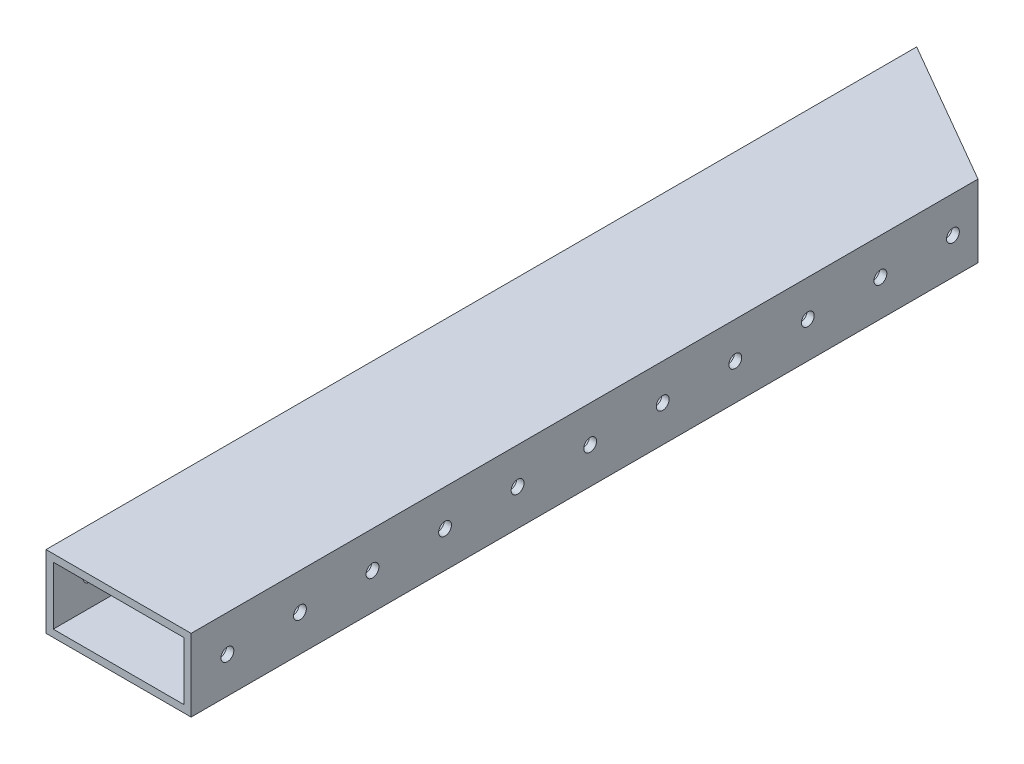
ISO-10303-21;
HEADER;
FILE_DESCRIPTION(('STEP AP214'),'2;1');
FILE_NAME('part.step','',(''),(''),'','','');
FILE_SCHEMA(('AUTOMOTIVE_DESIGN { 1 0 10303 214 1 1 1 1 }'));
ENDSEC;
DATA;
#1=APPLICATION_CONTEXT('core data for automotive mechanical design processes');
#2=APPLICATION_PROTOCOL_DEFINITION('international standard','automotive_design',2000,#1);
#3=PRODUCT_CONTEXT('',#1,'mechanical');
#4=PRODUCT('Part','Part','',(#3));
#5=PRODUCT_RELATED_PRODUCT_CATEGORY('part','',(#4));
#6=PRODUCT_DEFINITION_FORMATION('','',#4);
#7=PRODUCT_DEFINITION_CONTEXT('part definition',#1,'design');
#8=PRODUCT_DEFINITION('design','',#6,#7);
#9=PRODUCT_DEFINITION_SHAPE('','',#8);
#10=(LENGTH_UNIT() NAMED_UNIT(*) SI_UNIT(.MILLI.,.METRE.));
#11=(NAMED_UNIT(*) PLANE_ANGLE_UNIT() SI_UNIT($,.RADIAN.));
#12=(NAMED_UNIT(*) SI_UNIT($,.STERADIAN.) SOLID_ANGLE_UNIT());
#13=UNCERTAINTY_MEASURE_WITH_UNIT(LENGTH_MEASURE(1.E-05),#10,'distance_accuracy_value','');
#14=(GEOMETRIC_REPRESENTATION_CONTEXT(3) GLOBAL_UNCERTAINTY_ASSIGNED_CONTEXT((#13)) GLOBAL_UNIT_ASSIGNED_CONTEXT((#10,
#11,#12)) REPRESENTATION_CONTEXT('',''));
#15=CARTESIAN_POINT('',(0.,0.,0.));
#16=DIRECTION('',(0.,0.,1.));
#17=DIRECTION('',(1.,0.,0.));
#18=AXIS2_PLACEMENT_3D('',#15,#16,#17);
#19=CARTESIAN_POINT('',(-25.4,-12.7,-533.4));
#20=DIRECTION('',(-1.,0.,0.));
#21=DIRECTION('',(0.,0.,1.));
#22=AXIS2_PLACEMENT_3D('',#19,#20,#21);
#23=PLANE('',#22);
#24=DIRECTION('',(0.,-1.,0.));
#25=VECTOR('',#24,1.);
#26=CARTESIAN_POINT('',(-25.4,-12.7,-228.6));
#27=LINE('',#26,#25);
#28=CARTESIAN_POINT('',(-25.4,12.7,-228.6));
#29=VERTEX_POINT('',#28);
#30=CARTESIAN_POINT('',(-25.4,-12.7,-228.6));
#31=VERTEX_POINT('',#30);
#32=EDGE_CURVE('E127',#29,#31,#27,.T.);
#33=ORIENTED_EDGE('',*,*,#32,.F.);
#34=DIRECTION('',(0.,0.,1.));
#35=VECTOR('',#34,1.);
#36=CARTESIAN_POINT('',(-25.4,12.7,-533.4));
#37=LINE('',#36,#35);
#38=CARTESIAN_POINT('',(-25.4,12.7,-533.4));
#39=VERTEX_POINT('',#38);
#40=EDGE_CURVE('E121',#39,#29,#37,.T.);
#41=ORIENTED_EDGE('',*,*,#40,.F.);
#42=DIRECTION('',(0.,-1.,0.));
#43=VECTOR('',#42,1.);
#44=CARTESIAN_POINT('',(-25.4,-12.7,-533.4));
#45=LINE('',#44,#43);
#46=CARTESIAN_POINT('',(-25.4,-12.7,-533.4));
#47=VERTEX_POINT('',#46);
#48=EDGE_CURVE('E104',#39,#47,#45,.T.);
#49=ORIENTED_EDGE('',*,*,#48,.T.);
#50=DIRECTION('',(0.,0.,1.));
#51=VECTOR('',#50,1.);
#52=CARTESIAN_POINT('',(-25.4,-12.7,-533.4));
#53=LINE('',#52,#51);
#54=EDGE_CURVE('E129',#47,#31,#53,.T.);
#55=ORIENTED_EDGE('',*,*,#54,.T.);
#56=EDGE_LOOP('',(#33,#41,#49,#55));
#57=FACE_BOUND('',#56,.T.);
#58=CARTESIAN_POINT('',(-25.4,0.,-241.3));
#59=DIRECTION('',(1.,0.,0.));
#60=DIRECTION('',(0.,0.,-1.));
#61=AXIS2_PLACEMENT_3D('',#58,#59,#60);
#62=CIRCLE('',#61,2.24789999999999);
#63=CARTESIAN_POINT('',(-25.4,0.,-243.5479));
#64=VERTEX_POINT('',#63);
#65=EDGE_CURVE('E202',#64,#64,#62,.T.);
#66=ORIENTED_EDGE('',*,*,#65,.T.);
#67=EDGE_LOOP('',(#66));
#68=FACE_BOUND('',#67,.T.);
#69=CARTESIAN_POINT('',(-25.4,0.,-266.7));
#70=DIRECTION('',(1.,0.,0.));
#71=DIRECTION('',(0.,0.,-1.));
#72=AXIS2_PLACEMENT_3D('',#69,#70,#71);
#73=CIRCLE('',#72,2.24789999999999);
#74=CARTESIAN_POINT('',(-25.4,0.,-268.9479));
#75=VERTEX_POINT('',#74);
#76=EDGE_CURVE('E197',#75,#75,#73,.T.);
#77=ORIENTED_EDGE('',*,*,#76,.T.);
#78=EDGE_LOOP('',(#77));
#79=FACE_BOUND('',#78,.T.);
#80=CARTESIAN_POINT('',(-25.4,0.,-292.1));
#81=DIRECTION('',(1.,0.,0.));
#82=DIRECTION('',(0.,0.,-1.));
#83=AXIS2_PLACEMENT_3D('',#80,#81,#82);
#84=CIRCLE('',#83,2.24789999999999);
#85=CARTESIAN_POINT('',(-25.4,0.,-294.3479));
#86=VERTEX_POINT('',#85);
#87=EDGE_CURVE('E191',#86,#86,#84,.T.);
#88=ORIENTED_EDGE('',*,*,#87,.T.);
#89=EDGE_LOOP('',(#88));
#90=FACE_BOUND('',#89,.T.);
#91=CARTESIAN_POINT('',(-25.4,0.,-317.5));
#92=DIRECTION('',(1.,0.,0.));
#93=DIRECTION('',(0.,0.,-1.));
#94=AXIS2_PLACEMENT_3D('',#91,#92,#93);
#95=CIRCLE('',#94,2.24789999999999);
#96=CARTESIAN_POINT('',(-25.4,0.,-319.7479));
#97=VERTEX_POINT('',#96);
#98=EDGE_CURVE('E185',#97,#97,#95,.T.);
#99=ORIENTED_EDGE('',*,*,#98,.T.);
#100=EDGE_LOOP('',(#99));
#101=FACE_BOUND('',#100,.T.);
#102=CARTESIAN_POINT('',(-25.4,0.,-342.9));
#103=DIRECTION('',(1.,0.,0.));
#104=DIRECTION('',(0.,0.,-1.));
#105=AXIS2_PLACEMENT_3D('',#102,#103,#104);
#106=CIRCLE('',#105,2.24789999999999);
#107=CARTESIAN_POINT('',(-25.4,0.,-345.1479));
#108=VERTEX_POINT('',#107);
#109=EDGE_CURVE('E179',#108,#108,#106,.T.);
#110=ORIENTED_EDGE('',*,*,#109,.T.);
#111=EDGE_LOOP('',(#110));
#112=FACE_BOUND('',#111,.T.);
#113=CARTESIAN_POINT('',(-25.4,0.,-368.3));
#114=DIRECTION('',(1.,0.,0.));
#115=DIRECTION('',(0.,0.,-1.));
#116=AXIS2_PLACEMENT_3D('',#113,#114,#115);
#117=CIRCLE('',#116,2.24789999999999);
#118=CARTESIAN_POINT('',(-25.4,0.,-370.5479));
#119=VERTEX_POINT('',#118);
#120=EDGE_CURVE('E173',#119,#119,#117,.T.);
#121=ORIENTED_EDGE('',*,*,#120,.T.);
#122=EDGE_LOOP('',(#121));
#123=FACE_BOUND('',#122,.T.);
#124=CARTESIAN_POINT('',(-25.4,0.,-393.7));
#125=DIRECTION('',(1.,0.,0.));
#126=DIRECTION('',(0.,0.,-1.));
#127=AXIS2_PLACEMENT_3D('',#124,#125,#126);
#128=CIRCLE('',#127,2.24789999999999);
#129=CARTESIAN_POINT('',(-25.4,0.,-395.9479));
#130=VERTEX_POINT('',#129);
#131=EDGE_CURVE('E167',#130,#130,#128,.T.);
#132=ORIENTED_EDGE('',*,*,#131,.T.);
#133=EDGE_LOOP('',(#132));
#134=FACE_BOUND('',#133,.T.);
#135=CARTESIAN_POINT('',(-25.4,0.,-419.1));
#136=DIRECTION('',(1.,0.,0.));
#137=DIRECTION('',(0.,0.,-1.));
#138=AXIS2_PLACEMENT_3D('',#135,#136,#137);
#139=CIRCLE('',#138,2.24789999999999);
#140=CARTESIAN_POINT('',(-25.4,0.,-421.3479));
#141=VERTEX_POINT('',#140);
#142=EDGE_CURVE('E161',#141,#141,#139,.T.);
#143=ORIENTED_EDGE('',*,*,#142,.T.);
#144=EDGE_LOOP('',(#143));
#145=FACE_BOUND('',#144,.T.);
#146=CARTESIAN_POINT('',(-25.4,0.,-444.5));
#147=DIRECTION('',(1.,0.,0.));
#148=DIRECTION('',(0.,0.,-1.));
#149=AXIS2_PLACEMENT_3D('',#146,#147,#148);
#150=CIRCLE('',#149,2.24789999999999);
#151=CARTESIAN_POINT('',(-25.4,0.,-446.7479));
#152=VERTEX_POINT('',#151);
#153=EDGE_CURVE('E155',#152,#152,#150,.T.);
#154=ORIENTED_EDGE('',*,*,#153,.T.);
#155=EDGE_LOOP('',(#154));
#156=FACE_BOUND('',#155,.T.);
#157=CARTESIAN_POINT('',(-25.4,0.,-469.9));
#158=DIRECTION('',(1.,0.,0.));
#159=DIRECTION('',(0.,0.,-1.));
#160=AXIS2_PLACEMENT_3D('',#157,#158,#159);
#161=CIRCLE('',#160,2.24789999999999);
#162=CARTESIAN_POINT('',(-25.4,0.,-472.1479));
#163=VERTEX_POINT('',#162);
#164=EDGE_CURVE('E149',#163,#163,#161,.T.);
#165=ORIENTED_EDGE('',*,*,#164,.T.);
#166=EDGE_LOOP('',(#165));
#167=FACE_BOUND('',#166,.T.);
#168=CARTESIAN_POINT('',(-25.4,0.,-495.3));
#169=DIRECTION('',(1.,0.,0.));
#170=DIRECTION('',(0.,0.,-1.));
#171=AXIS2_PLACEMENT_3D('',#168,#169,#170);
#172=CIRCLE('',#171,2.24789999999999);
#173=CARTESIAN_POINT('',(-25.4,0.,-497.5479));
#174=VERTEX_POINT('',#173);
#175=EDGE_CURVE('E143',#174,#174,#172,.T.);
#176=ORIENTED_EDGE('',*,*,#175,.T.);
#177=EDGE_LOOP('',(#176));
#178=FACE_BOUND('',#177,.T.);
#179=CARTESIAN_POINT('',(-25.4,0.,-520.7));
#180=DIRECTION('',(1.,0.,0.));
#181=DIRECTION('',(0.,0.,-1.));
#182=AXIS2_PLACEMENT_3D('',#179,#180,#181);
#183=CIRCLE('',#182,2.24789999999999);
#184=CARTESIAN_POINT('',(-25.4,0.,-522.9479));
#185=VERTEX_POINT('',#184);
#186=EDGE_CURVE('E229',#185,#185,#183,.T.);
#187=ORIENTED_EDGE('',*,*,#186,.T.);
#188=EDGE_LOOP('',(#187));
#189=FACE_BOUND('',#188,.T.);
#190=ADVANCED_FACE('F38',(#57,#68,#79,#90,#101,#112,#123,#134,#145,#156,#167,#178,#189),#23,.T.);
#191=CARTESIAN_POINT('',(25.4,-12.7,-533.4));
#192=DIRECTION('',(1.,0.,0.));
#193=DIRECTION('',(0.,0.,-1.));
#194=AXIS2_PLACEMENT_3D('',#191,#192,#193);
#195=PLANE('',#194);
#196=DIRECTION('',(0.,1.,0.));
#197=VECTOR('',#196,1.);
#198=CARTESIAN_POINT('',(25.4,-27.94,-504.070606325167));
#199=LINE('',#198,#197);
#200=CARTESIAN_POINT('',(25.4,-12.7,-504.070606325167));
#201=VERTEX_POINT('',#200);
#202=CARTESIAN_POINT('',(25.4,12.7,-504.070606325167));
#203=VERTEX_POINT('',#202);
#204=EDGE_CURVE('E123',#201,#203,#199,.T.);
#205=ORIENTED_EDGE('',*,*,#204,.T.);
#206=DIRECTION('',(0.,0.,1.));
#207=VECTOR('',#206,1.);
#208=CARTESIAN_POINT('',(25.4,12.7,-533.4));
#209=LINE('',#208,#207);
#210=CARTESIAN_POINT('',(25.4,12.7,-228.6));
#211=VERTEX_POINT('',#210);
#212=EDGE_CURVE('E61',#203,#211,#209,.T.);
#213=ORIENTED_EDGE('',*,*,#212,.T.);
#214=DIRECTION('',(0.,1.,0.));
#215=VECTOR('',#214,1.);
#216=CARTESIAN_POINT('',(25.4,-12.7,-228.6));
#217=LINE('',#216,#215);
#218=CARTESIAN_POINT('',(25.4,-12.7,-228.6));
#219=VERTEX_POINT('',#218);
#220=EDGE_CURVE('E345',#219,#211,#217,.T.);
#221=ORIENTED_EDGE('',*,*,#220,.F.);
#222=DIRECTION('',(0.,0.,1.));
#223=VECTOR('',#222,1.);
#224=CARTESIAN_POINT('',(25.4,-12.7,-533.4));
#225=LINE('',#224,#223);
#226=EDGE_CURVE('E133',#201,#219,#225,.T.);
#227=ORIENTED_EDGE('',*,*,#226,.F.);
#228=EDGE_LOOP('',(#205,#213,#221,#227));
#229=FACE_BOUND('',#228,.T.);
#230=CARTESIAN_POINT('',(25.4,0.,-241.3));
#231=DIRECTION('',(1.,0.,0.));
#232=DIRECTION('',(0.,0.,-1.));
#233=AXIS2_PLACEMENT_3D('',#230,#231,#232);
#234=CIRCLE('',#233,2.24789999999999);
#235=CARTESIAN_POINT('',(25.4,0.,-243.5479));
#236=VERTEX_POINT('',#235);
#237=EDGE_CURVE('E339',#236,#236,#234,.T.);
#238=ORIENTED_EDGE('',*,*,#237,.F.);
#239=EDGE_LOOP('',(#238));
#240=FACE_BOUND('',#239,.T.);
#241=CARTESIAN_POINT('',(25.4,0.,-266.7));
#242=DIRECTION('',(1.,0.,0.));
#243=DIRECTION('',(0.,0.,-1.));
#244=AXIS2_PLACEMENT_3D('',#241,#242,#243);
#245=CIRCLE('',#244,2.24789999999999);
#246=CARTESIAN_POINT('',(25.4,0.,-268.9479));
#247=VERTEX_POINT('',#246);
#248=EDGE_CURVE('E329',#247,#247,#245,.T.);
#249=ORIENTED_EDGE('',*,*,#248,.F.);
#250=EDGE_LOOP('',(#249));
#251=FACE_BOUND('',#250,.T.);
#252=CARTESIAN_POINT('',(25.4,0.,-292.1));
#253=DIRECTION('',(1.,0.,0.));
#254=DIRECTION('',(0.,0.,-1.));
#255=AXIS2_PLACEMENT_3D('',#252,#253,#254);
#256=CIRCLE('',#255,2.24789999999999);
#257=CARTESIAN_POINT('',(25.4,0.,-294.3479));
#258=VERTEX_POINT('',#257);
#259=EDGE_CURVE('E319',#258,#258,#256,.T.);
#260=ORIENTED_EDGE('',*,*,#259,.F.);
#261=EDGE_LOOP('',(#260));
#262=FACE_BOUND('',#261,.T.);
#263=CARTESIAN_POINT('',(25.4,0.,-317.5));
#264=DIRECTION('',(1.,0.,0.));
#265=DIRECTION('',(0.,0.,-1.));
#266=AXIS2_PLACEMENT_3D('',#263,#264,#265);
#267=CIRCLE('',#266,2.24789999999999);
#268=CARTESIAN_POINT('',(25.4,0.,-319.7479));
#269=VERTEX_POINT('',#268);
#270=EDGE_CURVE('E309',#269,#269,#267,.T.);
#271=ORIENTED_EDGE('',*,*,#270,.F.);
#272=EDGE_LOOP('',(#271));
#273=FACE_BOUND('',#272,.T.);
#274=CARTESIAN_POINT('',(25.4,0.,-342.9));
#275=DIRECTION('',(1.,0.,0.));
#276=DIRECTION('',(0.,0.,-1.));
#277=AXIS2_PLACEMENT_3D('',#274,#275,#276);
#278=CIRCLE('',#277,2.24789999999999);
#279=CARTESIAN_POINT('',(25.4,0.,-345.1479));
#280=VERTEX_POINT('',#279);
#281=EDGE_CURVE('E299',#280,#280,#278,.T.);
#282=ORIENTED_EDGE('',*,*,#281,.F.);
#283=EDGE_LOOP('',(#282));
#284=FACE_BOUND('',#283,.T.);
#285=CARTESIAN_POINT('',(25.4,0.,-368.3));
#286=DIRECTION('',(1.,0.,0.));
#287=DIRECTION('',(0.,0.,-1.));
#288=AXIS2_PLACEMENT_3D('',#285,#286,#287);
#289=CIRCLE('',#288,2.24789999999999);
#290=CARTESIAN_POINT('',(25.4,0.,-370.5479));
#291=VERTEX_POINT('',#290);
#292=EDGE_CURVE('E289',#291,#291,#289,.T.);
#293=ORIENTED_EDGE('',*,*,#292,.F.);
#294=EDGE_LOOP('',(#293));
#295=FACE_BOUND('',#294,.T.);
#296=CARTESIAN_POINT('',(25.4,0.,-393.7));
#297=DIRECTION('',(1.,0.,0.));
#298=DIRECTION('',(0.,0.,-1.));
#299=AXIS2_PLACEMENT_3D('',#296,#297,#298);
#300=CIRCLE('',#299,2.24789999999999);
#301=CARTESIAN_POINT('',(25.4,0.,-395.9479));
#302=VERTEX_POINT('',#301);
#303=EDGE_CURVE('E279',#302,#302,#300,.T.);
#304=ORIENTED_EDGE('',*,*,#303,.F.);
#305=EDGE_LOOP('',(#304));
#306=FACE_BOUND('',#305,.T.);
#307=CARTESIAN_POINT('',(25.4,0.,-419.1));
#308=DIRECTION('',(1.,0.,0.));
#309=DIRECTION('',(0.,0.,-1.));
#310=AXIS2_PLACEMENT_3D('',#307,#308,#309);
#311=CIRCLE('',#310,2.24789999999999);
#312=CARTESIAN_POINT('',(25.4,0.,-421.3479));
#313=VERTEX_POINT('',#312);
#314=EDGE_CURVE('E269',#313,#313,#311,.T.);
#315=ORIENTED_EDGE('',*,*,#314,.F.);
#316=EDGE_LOOP('',(#315));
#317=FACE_BOUND('',#316,.T.);
#318=CARTESIAN_POINT('',(25.4,0.,-444.5));
#319=DIRECTION('',(1.,0.,0.));
#320=DIRECTION('',(0.,0.,-1.));
#321=AXIS2_PLACEMENT_3D('',#318,#319,#320);
#322=CIRCLE('',#321,2.24789999999999);
#323=CARTESIAN_POINT('',(25.4,0.,-446.7479));
#324=VERTEX_POINT('',#323);
#325=EDGE_CURVE('E259',#324,#324,#322,.T.);
#326=ORIENTED_EDGE('',*,*,#325,.F.);
#327=EDGE_LOOP('',(#326));
#328=FACE_BOUND('',#327,.T.);
#329=CARTESIAN_POINT('',(25.4,0.,-469.9));
#330=DIRECTION('',(1.,0.,0.));
#331=DIRECTION('',(0.,0.,-1.));
#332=AXIS2_PLACEMENT_3D('',#329,#330,#331);
#333=CIRCLE('',#332,2.24789999999999);
#334=CARTESIAN_POINT('',(25.4,0.,-472.1479));
#335=VERTEX_POINT('',#334);
#336=EDGE_CURVE('E249',#335,#335,#333,.T.);
#337=ORIENTED_EDGE('',*,*,#336,.F.);
#338=EDGE_LOOP('',(#337));
#339=FACE_BOUND('',#338,.T.);
#340=CARTESIAN_POINT('',(25.4,0.,-495.3));
#341=DIRECTION('',(1.,0.,0.));
#342=DIRECTION('',(0.,0.,-1.));
#343=AXIS2_PLACEMENT_3D('',#340,#341,#342);
#344=CIRCLE('',#343,2.24789999999999);
#345=CARTESIAN_POINT('',(25.4,0.,-497.5479));
#346=VERTEX_POINT('',#345);
#347=EDGE_CURVE('E239',#346,#346,#344,.T.);
#348=ORIENTED_EDGE('',*,*,#347,.F.);
#349=EDGE_LOOP('',(#348));
#350=FACE_BOUND('',#349,.T.);
#351=ADVANCED_FACE('F40',(#229,#240,#251,#262,#273,#284,#295,#306,#317,#328,#339,#350),#195,.T.);
#352=CARTESIAN_POINT('',(-25.4,-12.7,-533.4));
#353=DIRECTION('',(0.,-1.,0.));
#354=DIRECTION('',(0.,0.,-1.));
#355=AXIS2_PLACEMENT_3D('',#352,#353,#354);
#356=PLANE('',#355);
#357=DIRECTION('',(-0.866025403784442,0.,-0.499999999999995));
#358=VECTOR('',#357,1.);
#359=CARTESIAN_POINT('',(-25.4,-12.7,-533.4));
#360=LINE('',#359,#358);
#361=EDGE_CURVE('E109',#201,#47,#360,.T.);
#362=ORIENTED_EDGE('',*,*,#361,.F.);
#363=ORIENTED_EDGE('',*,*,#226,.T.);
#364=DIRECTION('',(1.,0.,0.));
#365=VECTOR('',#364,1.);
#366=CARTESIAN_POINT('',(-25.4,-12.7,-228.6));
#367=LINE('',#366,#365);
#368=EDGE_CURVE('E348',#31,#219,#367,.T.);
#369=ORIENTED_EDGE('',*,*,#368,.F.);
#370=ORIENTED_EDGE('',*,*,#54,.F.);
#371=EDGE_LOOP('',(#362,#363,#369,#370));
#372=FACE_BOUND('',#371,.T.);
#373=ADVANCED_FACE('F380',(#372),#356,.T.);
#374=CARTESIAN_POINT('',(-25.4,12.7,-533.4));
#375=DIRECTION('',(0.,1.,0.));
#376=DIRECTION('',(0.,0.,1.));
#377=AXIS2_PLACEMENT_3D('',#374,#375,#376);
#378=PLANE('',#377);
#379=DIRECTION('',(0.866025403784442,0.,0.499999999999994));
#380=VECTOR('',#379,1.);
#381=CARTESIAN_POINT('',(-25.4,12.7,-533.4));
#382=LINE('',#381,#380);
#383=EDGE_CURVE('E107',#39,#203,#382,.T.);
#384=ORIENTED_EDGE('',*,*,#383,.F.);
#385=ORIENTED_EDGE('',*,*,#40,.T.);
#386=DIRECTION('',(-1.,0.,0.));
#387=VECTOR('',#386,1.);
#388=CARTESIAN_POINT('',(-94.0568861231913,12.7,-228.6));
#389=LINE('',#388,#387);
#390=EDGE_CURVE('E363',#211,#29,#389,.T.);
#391=ORIENTED_EDGE('',*,*,#390,.F.);
#392=ORIENTED_EDGE('',*,*,#212,.F.);
#393=EDGE_LOOP('',(#384,#385,#391,#392));
#394=FACE_BOUND('',#393,.T.);
#395=ADVANCED_FACE('F119',(#394),#378,.T.);
#396=CARTESIAN_POINT('',(22.86,-10.16,-533.4));
#397=DIRECTION('',(1.,0.,0.));
#398=DIRECTION('',(0.,0.,-1.));
#399=AXIS2_PLACEMENT_3D('',#396,#397,#398);
#400=PLANE('',#399);
#401=CARTESIAN_POINT('',(22.86,0.,-241.3));
#402=DIRECTION('',(1.,0.,0.));
#403=DIRECTION('',(0.,0.,-1.));
#404=AXIS2_PLACEMENT_3D('',#401,#402,#403);
#405=CIRCLE('',#404,2.24789999999999);
#406=CARTESIAN_POINT('',(22.86,0.,-243.5479));
#407=VERTEX_POINT('',#406);
#408=EDGE_CURVE('E201',#407,#407,#405,.T.);
#409=ORIENTED_EDGE('',*,*,#408,.T.);
#410=EDGE_LOOP('',(#409));
#411=FACE_BOUND('',#410,.T.);
#412=CARTESIAN_POINT('',(22.86,0.,-266.7));
#413=DIRECTION('',(1.,0.,0.));
#414=DIRECTION('',(0.,0.,-1.));
#415=AXIS2_PLACEMENT_3D('',#412,#413,#414);
#416=CIRCLE('',#415,2.24789999999999);
#417=CARTESIAN_POINT('',(22.86,0.,-268.9479));
#418=VERTEX_POINT('',#417);
#419=EDGE_CURVE('E196',#418,#418,#416,.T.);
#420=ORIENTED_EDGE('',*,*,#419,.T.);
#421=EDGE_LOOP('',(#420));
#422=FACE_BOUND('',#421,.T.);
#423=CARTESIAN_POINT('',(22.86,0.,-292.1));
#424=DIRECTION('',(1.,0.,0.));
#425=DIRECTION('',(0.,0.,-1.));
#426=AXIS2_PLACEMENT_3D('',#423,#424,#425);
#427=CIRCLE('',#426,2.24789999999999);
#428=CARTESIAN_POINT('',(22.86,0.,-294.3479));
#429=VERTEX_POINT('',#428);
#430=EDGE_CURVE('E190',#429,#429,#427,.T.);
#431=ORIENTED_EDGE('',*,*,#430,.T.);
#432=EDGE_LOOP('',(#431));
#433=FACE_BOUND('',#432,.T.);
#434=CARTESIAN_POINT('',(22.86,0.,-317.5));
#435=DIRECTION('',(1.,0.,0.));
#436=DIRECTION('',(0.,0.,-1.));
#437=AXIS2_PLACEMENT_3D('',#434,#435,#436);
#438=CIRCLE('',#437,2.24789999999999);
#439=CARTESIAN_POINT('',(22.86,0.,-319.7479));
#440=VERTEX_POINT('',#439);
#441=EDGE_CURVE('E184',#440,#440,#438,.T.);
#442=ORIENTED_EDGE('',*,*,#441,.T.);
#443=EDGE_LOOP('',(#442));
#444=FACE_BOUND('',#443,.T.);
#445=CARTESIAN_POINT('',(22.86,0.,-342.9));
#446=DIRECTION('',(1.,0.,0.));
#447=DIRECTION('',(0.,0.,-1.));
#448=AXIS2_PLACEMENT_3D('',#445,#446,#447);
#449=CIRCLE('',#448,2.24789999999999);
#450=CARTESIAN_POINT('',(22.86,0.,-345.1479));
#451=VERTEX_POINT('',#450);
#452=EDGE_CURVE('E178',#451,#451,#449,.T.);
#453=ORIENTED_EDGE('',*,*,#452,.T.);
#454=EDGE_LOOP('',(#453));
#455=FACE_BOUND('',#454,.T.);
#456=CARTESIAN_POINT('',(22.86,0.,-368.3));
#457=DIRECTION('',(1.,0.,0.));
#458=DIRECTION('',(0.,0.,-1.));
#459=AXIS2_PLACEMENT_3D('',#456,#457,#458);
#460=CIRCLE('',#459,2.24789999999999);
#461=CARTESIAN_POINT('',(22.86,0.,-370.5479));
#462=VERTEX_POINT('',#461);
#463=EDGE_CURVE('E172',#462,#462,#460,.T.);
#464=ORIENTED_EDGE('',*,*,#463,.T.);
#465=EDGE_LOOP('',(#464));
#466=FACE_BOUND('',#465,.T.);
#467=CARTESIAN_POINT('',(22.86,0.,-393.7));
#468=DIRECTION('',(1.,0.,0.));
#469=DIRECTION('',(0.,0.,-1.));
#470=AXIS2_PLACEMENT_3D('',#467,#468,#469);
#471=CIRCLE('',#470,2.24789999999999);
#472=CARTESIAN_POINT('',(22.86,0.,-395.9479));
#473=VERTEX_POINT('',#472);
#474=EDGE_CURVE('E166',#473,#473,#471,.T.);
#475=ORIENTED_EDGE('',*,*,#474,.T.);
#476=EDGE_LOOP('',(#475));
#477=FACE_BOUND('',#476,.T.);
#478=CARTESIAN_POINT('',(22.86,0.,-419.1));
#479=DIRECTION('',(1.,0.,0.));
#480=DIRECTION('',(0.,0.,-1.));
#481=AXIS2_PLACEMENT_3D('',#478,#479,#480);
#482=CIRCLE('',#481,2.24789999999999);
#483=CARTESIAN_POINT('',(22.86,0.,-421.3479));
#484=VERTEX_POINT('',#483);
#485=EDGE_CURVE('E160',#484,#484,#482,.T.);
#486=ORIENTED_EDGE('',*,*,#485,.T.);
#487=EDGE_LOOP('',(#486));
#488=FACE_BOUND('',#487,.T.);
#489=CARTESIAN_POINT('',(22.86,0.,-444.5));
#490=DIRECTION('',(1.,0.,0.));
#491=DIRECTION('',(0.,0.,-1.));
#492=AXIS2_PLACEMENT_3D('',#489,#490,#491);
#493=CIRCLE('',#492,2.24789999999999);
#494=CARTESIAN_POINT('',(22.86,0.,-446.7479));
#495=VERTEX_POINT('',#494);
#496=EDGE_CURVE('E150',#495,#495,#493,.T.);
#497=ORIENTED_EDGE('',*,*,#496,.T.);
#498=EDGE_LOOP('',(#497));
#499=FACE_BOUND('',#498,.T.);
#500=CARTESIAN_POINT('',(22.86,0.,-469.9));
#501=DIRECTION('',(1.,0.,0.));
#502=DIRECTION('',(0.,0.,-1.));
#503=AXIS2_PLACEMENT_3D('',#500,#501,#502);
#504=CIRCLE('',#503,2.24789999999999);
#505=CARTESIAN_POINT('',(22.86,0.,-472.1479));
#506=VERTEX_POINT('',#505);
#507=EDGE_CURVE('E144',#506,#506,#504,.T.);
#508=ORIENTED_EDGE('',*,*,#507,.T.);
#509=EDGE_LOOP('',(#508));
#510=FACE_BOUND('',#509,.T.);
#511=CARTESIAN_POINT('',(22.86,0.,-495.3));
#512=DIRECTION('',(1.,0.,0.));
#513=DIRECTION('',(0.,0.,-1.));
#514=AXIS2_PLACEMENT_3D('',#511,#512,#513);
#515=CIRCLE('',#514,2.24789999999999);
#516=CARTESIAN_POINT('',(22.86,0.,-497.5479));
#517=VERTEX_POINT('',#516);
#518=EDGE_CURVE('E138',#517,#517,#515,.T.);
#519=ORIENTED_EDGE('',*,*,#518,.T.);
#520=EDGE_LOOP('',(#519));
#521=FACE_BOUND('',#520,.T.);
#522=DIRECTION('',(0.,0.,1.));
#523=VECTOR('',#522,1.);
#524=CARTESIAN_POINT('',(22.86,10.16,-533.4));
#525=LINE('',#524,#523);
#526=CARTESIAN_POINT('',(22.86,10.16,-505.537076008909));
#527=VERTEX_POINT('',#526);
#528=CARTESIAN_POINT('',(22.86,10.16,-228.6));
#529=VERTEX_POINT('',#528);
#530=EDGE_CURVE('E214',#527,#529,#525,.T.);
#531=ORIENTED_EDGE('',*,*,#530,.F.);
#532=DIRECTION('',(0.,-1.,0.));
#533=VECTOR('',#532,1.);
#534=CARTESIAN_POINT('',(22.86,-10.16,-505.537076008909));
#535=LINE('',#534,#533);
#536=CARTESIAN_POINT('',(22.86,-10.16,-505.537076008909));
#537=VERTEX_POINT('',#536);
#538=EDGE_CURVE('E54',#527,#537,#535,.T.);
#539=ORIENTED_EDGE('',*,*,#538,.T.);
#540=DIRECTION('',(0.,0.,1.));
#541=VECTOR('',#540,1.);
#542=CARTESIAN_POINT('',(22.86,-10.16,-533.4));
#543=LINE('',#542,#541);
#544=CARTESIAN_POINT('',(22.86,-10.16,-228.6));
#545=VERTEX_POINT('',#544);
#546=EDGE_CURVE('E115',#537,#545,#543,.T.);
#547=ORIENTED_EDGE('',*,*,#546,.T.);
#548=DIRECTION('',(0.,1.,0.));
#549=VECTOR('',#548,1.);
#550=CARTESIAN_POINT('',(22.86,-10.16,-228.6));
#551=LINE('',#550,#549);
#552=EDGE_CURVE('E351',#545,#529,#551,.T.);
#553=ORIENTED_EDGE('',*,*,#552,.T.);
#554=EDGE_LOOP('',(#531,#539,#547,#553));
#555=FACE_BOUND('',#554,.T.);
#556=ADVANCED_FACE('F398',(#411,#422,#433,#444,#455,#466,#477,#488,#499,#510,#521,#555),#400,.F.);
#557=CARTESIAN_POINT('',(-22.86,-10.16,-533.4));
#558=DIRECTION('',(0.,-1.,0.));
#559=DIRECTION('',(0.,0.,-1.));
#560=AXIS2_PLACEMENT_3D('',#557,#558,#559);
#561=PLANE('',#560);
#562=ORIENTED_EDGE('',*,*,#546,.F.);
#563=DIRECTION('',(-0.866025403784442,0.,-0.499999999999995));
#564=VECTOR('',#563,1.);
#565=CARTESIAN_POINT('',(-23.495,-10.16,-532.300147737194));
#566=LINE('',#565,#564);
#567=CARTESIAN_POINT('',(-22.86,-10.16,-531.933530316258));
#568=VERTEX_POINT('',#567);
#569=EDGE_CURVE('E370',#537,#568,#566,.T.);
#570=ORIENTED_EDGE('',*,*,#569,.T.);
#571=DIRECTION('',(0.,0.,1.));
#572=VECTOR('',#571,1.);
#573=CARTESIAN_POINT('',(-22.86,-10.16,-533.4));
#574=LINE('',#573,#572);
#575=CARTESIAN_POINT('',(-22.86,-10.16,-228.6));
#576=VERTEX_POINT('',#575);
#577=EDGE_CURVE('E221',#568,#576,#574,.T.);
#578=ORIENTED_EDGE('',*,*,#577,.T.);
#579=DIRECTION('',(1.,0.,0.));
#580=VECTOR('',#579,1.);
#581=CARTESIAN_POINT('',(-22.86,-10.16,-228.6));
#582=LINE('',#581,#580);
#583=EDGE_CURVE('E355',#576,#545,#582,.T.);
#584=ORIENTED_EDGE('',*,*,#583,.T.);
#585=EDGE_LOOP('',(#562,#570,#578,#584));
#586=FACE_BOUND('',#585,.T.);
#587=ADVANCED_FACE('F399',(#586),#561,.F.);
#588=CARTESIAN_POINT('',(-22.86,-10.16,-533.4));
#589=DIRECTION('',(-1.,0.,0.));
#590=DIRECTION('',(0.,0.,1.));
#591=AXIS2_PLACEMENT_3D('',#588,#589,#590);
#592=PLANE('',#591);
#593=CARTESIAN_POINT('',(-22.86,0.,-241.3));
#594=DIRECTION('',(-1.,0.,0.));
#595=DIRECTION('',(0.,0.,1.));
#596=AXIS2_PLACEMENT_3D('',#593,#594,#595);
#597=CIRCLE('',#596,2.24789999999999);
#598=CARTESIAN_POINT('',(-22.86,0.,-239.0521));
#599=VERTEX_POINT('',#598);
#600=EDGE_CURVE('E198',#599,#599,#597,.T.);
#601=ORIENTED_EDGE('',*,*,#600,.T.);
#602=EDGE_LOOP('',(#601));
#603=FACE_BOUND('',#602,.T.);
#604=CARTESIAN_POINT('',(-22.86,0.,-266.7));
#605=DIRECTION('',(-1.,0.,0.));
#606=DIRECTION('',(0.,0.,1.));
#607=AXIS2_PLACEMENT_3D('',#604,#605,#606);
#608=CIRCLE('',#607,2.24789999999999);
#609=CARTESIAN_POINT('',(-22.86,0.,-264.4521));
#610=VERTEX_POINT('',#609);
#611=EDGE_CURVE('E192',#610,#610,#608,.T.);
#612=ORIENTED_EDGE('',*,*,#611,.T.);
#613=EDGE_LOOP('',(#612));
#614=FACE_BOUND('',#613,.T.);
#615=CARTESIAN_POINT('',(-22.86,0.,-292.1));
#616=DIRECTION('',(-1.,0.,0.));
#617=DIRECTION('',(0.,0.,1.));
#618=AXIS2_PLACEMENT_3D('',#615,#616,#617);
#619=CIRCLE('',#618,2.24789999999999);
#620=CARTESIAN_POINT('',(-22.86,0.,-289.8521));
#621=VERTEX_POINT('',#620);
#622=EDGE_CURVE('E186',#621,#621,#619,.T.);
#623=ORIENTED_EDGE('',*,*,#622,.T.);
#624=EDGE_LOOP('',(#623));
#625=FACE_BOUND('',#624,.T.);
#626=CARTESIAN_POINT('',(-22.86,0.,-317.5));
#627=DIRECTION('',(-1.,0.,0.));
#628=DIRECTION('',(0.,0.,1.));
#629=AXIS2_PLACEMENT_3D('',#626,#627,#628);
#630=CIRCLE('',#629,2.24789999999999);
#631=CARTESIAN_POINT('',(-22.86,0.,-315.2521));
#632=VERTEX_POINT('',#631);
#633=EDGE_CURVE('E180',#632,#632,#630,.T.);
#634=ORIENTED_EDGE('',*,*,#633,.T.);
#635=EDGE_LOOP('',(#634));
#636=FACE_BOUND('',#635,.T.);
#637=CARTESIAN_POINT('',(-22.86,0.,-342.9));
#638=DIRECTION('',(-1.,0.,0.));
#639=DIRECTION('',(0.,0.,1.));
#640=AXIS2_PLACEMENT_3D('',#637,#638,#639);
#641=CIRCLE('',#640,2.24789999999999);
#642=CARTESIAN_POINT('',(-22.86,0.,-340.6521));
#643=VERTEX_POINT('',#642);
#644=EDGE_CURVE('E174',#643,#643,#641,.T.);
#645=ORIENTED_EDGE('',*,*,#644,.T.);
#646=EDGE_LOOP('',(#645));
#647=FACE_BOUND('',#646,.T.);
#648=CARTESIAN_POINT('',(-22.86,0.,-368.3));
#649=DIRECTION('',(-1.,0.,0.));
#650=DIRECTION('',(0.,0.,1.));
#651=AXIS2_PLACEMENT_3D('',#648,#649,#650);
#652=CIRCLE('',#651,2.24789999999999);
#653=CARTESIAN_POINT('',(-22.86,0.,-366.0521));
#654=VERTEX_POINT('',#653);
#655=EDGE_CURVE('E168',#654,#654,#652,.T.);
#656=ORIENTED_EDGE('',*,*,#655,.T.);
#657=EDGE_LOOP('',(#656));
#658=FACE_BOUND('',#657,.T.);
#659=CARTESIAN_POINT('',(-22.86,0.,-393.7));
#660=DIRECTION('',(-1.,0.,0.));
#661=DIRECTION('',(0.,0.,1.));
#662=AXIS2_PLACEMENT_3D('',#659,#660,#661);
#663=CIRCLE('',#662,2.24789999999999);
#664=CARTESIAN_POINT('',(-22.86,0.,-391.4521));
#665=VERTEX_POINT('',#664);
#666=EDGE_CURVE('E162',#665,#665,#663,.T.);
#667=ORIENTED_EDGE('',*,*,#666,.T.);
#668=EDGE_LOOP('',(#667));
#669=FACE_BOUND('',#668,.T.);
#670=CARTESIAN_POINT('',(-22.86,0.,-419.1));
#671=DIRECTION('',(-1.,0.,0.));
#672=DIRECTION('',(0.,0.,1.));
#673=AXIS2_PLACEMENT_3D('',#670,#671,#672);
#674=CIRCLE('',#673,2.24789999999999);
#675=CARTESIAN_POINT('',(-22.86,0.,-416.8521));
#676=VERTEX_POINT('',#675);
#677=EDGE_CURVE('E156',#676,#676,#674,.T.);
#678=ORIENTED_EDGE('',*,*,#677,.T.);
#679=EDGE_LOOP('',(#678));
#680=FACE_BOUND('',#679,.T.);
#681=CARTESIAN_POINT('',(-22.86,0.,-444.5));
#682=DIRECTION('',(-1.,0.,0.));
#683=DIRECTION('',(0.,0.,1.));
#684=AXIS2_PLACEMENT_3D('',#681,#682,#683);
#685=CIRCLE('',#684,2.24789999999999);
#686=CARTESIAN_POINT('',(-22.86,0.,-442.2521));
#687=VERTEX_POINT('',#686);
#688=EDGE_CURVE('E154',#687,#687,#685,.T.);
#689=ORIENTED_EDGE('',*,*,#688,.T.);
#690=EDGE_LOOP('',(#689));
#691=FACE_BOUND('',#690,.T.);
#692=CARTESIAN_POINT('',(-22.86,0.,-469.9));
#693=DIRECTION('',(-1.,0.,0.));
#694=DIRECTION('',(0.,0.,1.));
#695=AXIS2_PLACEMENT_3D('',#692,#693,#694);
#696=CIRCLE('',#695,2.24789999999999);
#697=CARTESIAN_POINT('',(-22.86,0.,-467.6521));
#698=VERTEX_POINT('',#697);
#699=EDGE_CURVE('E148',#698,#698,#696,.T.);
#700=ORIENTED_EDGE('',*,*,#699,.T.);
#701=EDGE_LOOP('',(#700));
#702=FACE_BOUND('',#701,.T.);
#703=CARTESIAN_POINT('',(-22.86,0.,-495.3));
#704=DIRECTION('',(-1.,0.,0.));
#705=DIRECTION('',(0.,0.,1.));
#706=AXIS2_PLACEMENT_3D('',#703,#704,#705);
#707=CIRCLE('',#706,2.24789999999999);
#708=CARTESIAN_POINT('',(-22.86,0.,-493.0521));
#709=VERTEX_POINT('',#708);
#710=EDGE_CURVE('E142',#709,#709,#707,.T.);
#711=ORIENTED_EDGE('',*,*,#710,.T.);
#712=EDGE_LOOP('',(#711));
#713=FACE_BOUND('',#712,.T.);
#714=CARTESIAN_POINT('',(-22.86,0.,-520.7));
#715=DIRECTION('',(-1.,0.,0.));
#716=DIRECTION('',(0.,0.,1.));
#717=AXIS2_PLACEMENT_3D('',#714,#715,#716);
#718=CIRCLE('',#717,2.24789999999999);
#719=CARTESIAN_POINT('',(-22.86,0.,-518.4521));
#720=VERTEX_POINT('',#719);
#721=EDGE_CURVE('E218',#720,#720,#718,.T.);
#722=ORIENTED_EDGE('',*,*,#721,.T.);
#723=EDGE_LOOP('',(#722));
#724=FACE_BOUND('',#723,.T.);
#725=ORIENTED_EDGE('',*,*,#577,.F.);
#726=DIRECTION('',(0.,1.,0.));
#727=VECTOR('',#726,1.);
#728=CARTESIAN_POINT('',(-22.86,-10.16,-531.933530316258));
#729=LINE('',#728,#727);
#730=CARTESIAN_POINT('',(-22.86,10.16,-531.933530316258));
#731=VERTEX_POINT('',#730);
#732=EDGE_CURVE('E374',#568,#731,#729,.T.);
#733=ORIENTED_EDGE('',*,*,#732,.T.);
#734=DIRECTION('',(0.,0.,1.));
#735=VECTOR('',#734,1.);
#736=CARTESIAN_POINT('',(-22.86,10.16,-533.4));
#737=LINE('',#736,#735);
#738=CARTESIAN_POINT('',(-22.86,10.16,-228.6));
#739=VERTEX_POINT('',#738);
#740=EDGE_CURVE('E217',#731,#739,#737,.T.);
#741=ORIENTED_EDGE('',*,*,#740,.T.);
#742=DIRECTION('',(0.,-1.,0.));
#743=VECTOR('',#742,1.);
#744=CARTESIAN_POINT('',(-22.86,-10.16,-228.6));
#745=LINE('',#744,#743);
#746=EDGE_CURVE('E359',#739,#576,#745,.T.);
#747=ORIENTED_EDGE('',*,*,#746,.T.);
#748=EDGE_LOOP('',(#725,#733,#741,#747));
#749=FACE_BOUND('',#748,.T.);
#750=ADVANCED_FACE('F394',(#603,#614,#625,#636,#647,#658,#669,#680,#691,#702,#713,#724,#749),
#592,.F.);
#751=CARTESIAN_POINT('',(-22.86,10.16,-533.4));
#752=DIRECTION('',(0.,1.,0.));
#753=DIRECTION('',(0.,0.,1.));
#754=AXIS2_PLACEMENT_3D('',#751,#752,#753);
#755=PLANE('',#754);
#756=ORIENTED_EDGE('',*,*,#740,.F.);
#757=DIRECTION('',(0.866025403784442,0.,0.499999999999995));
#758=VECTOR('',#757,1.);
#759=CARTESIAN_POINT('',(-23.495,10.16,-532.300147737194));
#760=LINE('',#759,#758);
#761=EDGE_CURVE('E11',#731,#527,#760,.T.);
#762=ORIENTED_EDGE('',*,*,#761,.T.);
#763=ORIENTED_EDGE('',*,*,#530,.T.);
#764=DIRECTION('',(-1.,0.,0.));
#765=VECTOR('',#764,1.);
#766=CARTESIAN_POINT('',(-22.86,10.16,-228.6));
#767=LINE('',#766,#765);
#768=EDGE_CURVE('E47',#529,#739,#767,.T.);
#769=ORIENTED_EDGE('',*,*,#768,.T.);
#770=EDGE_LOOP('',(#756,#762,#763,#769));
#771=FACE_BOUND('',#770,.T.);
#772=ADVANCED_FACE('F395',(#771),#755,.F.);
#773=CARTESIAN_POINT('',(25.4,0.,-520.7));
#774=DIRECTION('',(1.,0.,0.));
#775=DIRECTION('',(0.,0.,-1.));
#776=AXIS2_PLACEMENT_3D('',#773,#774,#775);
#777=CYLINDRICAL_SURFACE('',#776,2.24789999999999);
#778=ORIENTED_EDGE('',*,*,#186,.F.);
#779=EDGE_LOOP('',(#778));
#780=FACE_BOUND('',#779,.T.);
#781=ORIENTED_EDGE('',*,*,#721,.F.);
#782=EDGE_LOOP('',(#781));
#783=FACE_BOUND('',#782,.T.);
#784=ADVANCED_FACE('F459',(#780,#783),#777,.F.);
#785=CARTESIAN_POINT('',(25.4,0.,-495.3));
#786=DIRECTION('',(1.,0.,0.));
#787=DIRECTION('',(0.,0.,-1.));
#788=AXIS2_PLACEMENT_3D('',#785,#786,#787);
#789=CYLINDRICAL_SURFACE('',#788,2.24789999999999);
#790=ORIENTED_EDGE('',*,*,#347,.T.);
#791=EDGE_LOOP('',(#790));
#792=FACE_BOUND('',#791,.T.);
#793=ORIENTED_EDGE('',*,*,#518,.F.);
#794=EDGE_LOOP('',(#793));
#795=FACE_BOUND('',#794,.T.);
#796=ADVANCED_FACE('F472',(#792,#795),#789,.F.);
#797=ORIENTED_EDGE('',*,*,#175,.F.);
#798=EDGE_LOOP('',(#797));
#799=FACE_BOUND('',#798,.T.);
#800=ORIENTED_EDGE('',*,*,#710,.F.);
#801=EDGE_LOOP('',(#800));
#802=FACE_BOUND('',#801,.T.);
#803=ADVANCED_FACE('F481',(#799,#802),#789,.F.);
#804=CARTESIAN_POINT('',(25.4,0.,-469.9));
#805=DIRECTION('',(1.,0.,0.));
#806=DIRECTION('',(0.,0.,-1.));
#807=AXIS2_PLACEMENT_3D('',#804,#805,#806);
#808=CYLINDRICAL_SURFACE('',#807,2.24789999999999);
#809=ORIENTED_EDGE('',*,*,#336,.T.);
#810=EDGE_LOOP('',(#809));
#811=FACE_BOUND('',#810,.T.);
#812=ORIENTED_EDGE('',*,*,#507,.F.);
#813=EDGE_LOOP('',(#812));
#814=FACE_BOUND('',#813,.T.);
#815=ADVANCED_FACE('F490',(#811,#814),#808,.F.);
#816=ORIENTED_EDGE('',*,*,#164,.F.);
#817=EDGE_LOOP('',(#816));
#818=FACE_BOUND('',#817,.T.);
#819=ORIENTED_EDGE('',*,*,#699,.F.);
#820=EDGE_LOOP('',(#819));
#821=FACE_BOUND('',#820,.T.);
#822=ADVANCED_FACE('F498',(#818,#821),#808,.F.);
#823=CARTESIAN_POINT('',(25.4,0.,-444.5));
#824=DIRECTION('',(1.,0.,0.));
#825=DIRECTION('',(0.,0.,-1.));
#826=AXIS2_PLACEMENT_3D('',#823,#824,#825);
#827=CYLINDRICAL_SURFACE('',#826,2.24789999999999);
#828=ORIENTED_EDGE('',*,*,#325,.T.);
#829=EDGE_LOOP('',(#828));
#830=FACE_BOUND('',#829,.T.);
#831=ORIENTED_EDGE('',*,*,#496,.F.);
#832=EDGE_LOOP('',(#831));
#833=FACE_BOUND('',#832,.T.);
#834=ADVANCED_FACE('F507',(#830,#833),#827,.F.);
#835=ORIENTED_EDGE('',*,*,#153,.F.);
#836=EDGE_LOOP('',(#835));
#837=FACE_BOUND('',#836,.T.);
#838=ORIENTED_EDGE('',*,*,#688,.F.);
#839=EDGE_LOOP('',(#838));
#840=FACE_BOUND('',#839,.T.);
#841=ADVANCED_FACE('F515',(#837,#840),#827,.F.);
#842=CARTESIAN_POINT('',(25.4,0.,-419.1));
#843=DIRECTION('',(1.,0.,0.));
#844=DIRECTION('',(0.,0.,-1.));
#845=AXIS2_PLACEMENT_3D('',#842,#843,#844);
#846=CYLINDRICAL_SURFACE('',#845,2.24789999999999);
#847=ORIENTED_EDGE('',*,*,#142,.F.);
#848=EDGE_LOOP('',(#847));
#849=FACE_BOUND('',#848,.T.);
#850=ORIENTED_EDGE('',*,*,#677,.F.);
#851=EDGE_LOOP('',(#850));
#852=FACE_BOUND('',#851,.T.);
#853=ADVANCED_FACE('F524',(#849,#852),#846,.F.);
#854=ORIENTED_EDGE('',*,*,#314,.T.);
#855=EDGE_LOOP('',(#854));
#856=FACE_BOUND('',#855,.T.);
#857=ORIENTED_EDGE('',*,*,#485,.F.);
#858=EDGE_LOOP('',(#857));
#859=FACE_BOUND('',#858,.T.);
#860=ADVANCED_FACE('F532',(#856,#859),#846,.F.);
#861=CARTESIAN_POINT('',(25.4,0.,-393.7));
#862=DIRECTION('',(1.,0.,0.));
#863=DIRECTION('',(0.,0.,-1.));
#864=AXIS2_PLACEMENT_3D('',#861,#862,#863);
#865=CYLINDRICAL_SURFACE('',#864,2.24789999999999);
#866=ORIENTED_EDGE('',*,*,#131,.F.);
#867=EDGE_LOOP('',(#866));
#868=FACE_BOUND('',#867,.T.);
#869=ORIENTED_EDGE('',*,*,#666,.F.);
#870=EDGE_LOOP('',(#869));
#871=FACE_BOUND('',#870,.T.);
#872=ADVANCED_FACE('F541',(#868,#871),#865,.F.);
#873=ORIENTED_EDGE('',*,*,#303,.T.);
#874=EDGE_LOOP('',(#873));
#875=FACE_BOUND('',#874,.T.);
#876=ORIENTED_EDGE('',*,*,#474,.F.);
#877=EDGE_LOOP('',(#876));
#878=FACE_BOUND('',#877,.T.);
#879=ADVANCED_FACE('F549',(#875,#878),#865,.F.);
#880=CARTESIAN_POINT('',(25.4,0.,-368.3));
#881=DIRECTION('',(1.,0.,0.));
#882=DIRECTION('',(0.,0.,-1.));
#883=AXIS2_PLACEMENT_3D('',#880,#881,#882);
#884=CYLINDRICAL_SURFACE('',#883,2.24789999999999);
#885=ORIENTED_EDGE('',*,*,#120,.F.);
#886=EDGE_LOOP('',(#885));
#887=FACE_BOUND('',#886,.T.);
#888=ORIENTED_EDGE('',*,*,#655,.F.);
#889=EDGE_LOOP('',(#888));
#890=FACE_BOUND('',#889,.T.);
#891=ADVANCED_FACE('F558',(#887,#890),#884,.F.);
#892=ORIENTED_EDGE('',*,*,#292,.T.);
#893=EDGE_LOOP('',(#892));
#894=FACE_BOUND('',#893,.T.);
#895=ORIENTED_EDGE('',*,*,#463,.F.);
#896=EDGE_LOOP('',(#895));
#897=FACE_BOUND('',#896,.T.);
#898=ADVANCED_FACE('F566',(#894,#897),#884,.F.);
#899=CARTESIAN_POINT('',(25.4,0.,-342.9));
#900=DIRECTION('',(1.,0.,0.));
#901=DIRECTION('',(0.,0.,-1.));
#902=AXIS2_PLACEMENT_3D('',#899,#900,#901);
#903=CYLINDRICAL_SURFACE('',#902,2.24789999999999);
#904=ORIENTED_EDGE('',*,*,#109,.F.);
#905=EDGE_LOOP('',(#904));
#906=FACE_BOUND('',#905,.T.);
#907=ORIENTED_EDGE('',*,*,#644,.F.);
#908=EDGE_LOOP('',(#907));
#909=FACE_BOUND('',#908,.T.);
#910=ADVANCED_FACE('F575',(#906,#909),#903,.F.);
#911=ORIENTED_EDGE('',*,*,#281,.T.);
#912=EDGE_LOOP('',(#911));
#913=FACE_BOUND('',#912,.T.);
#914=ORIENTED_EDGE('',*,*,#452,.F.);
#915=EDGE_LOOP('',(#914));
#916=FACE_BOUND('',#915,.T.);
#917=ADVANCED_FACE('F583',(#913,#916),#903,.F.);
#918=CARTESIAN_POINT('',(25.4,0.,-317.5));
#919=DIRECTION('',(1.,0.,0.));
#920=DIRECTION('',(0.,0.,-1.));
#921=AXIS2_PLACEMENT_3D('',#918,#919,#920);
#922=CYLINDRICAL_SURFACE('',#921,2.24789999999999);
#923=ORIENTED_EDGE('',*,*,#98,.F.);
#924=EDGE_LOOP('',(#923));
#925=FACE_BOUND('',#924,.T.);
#926=ORIENTED_EDGE('',*,*,#633,.F.);
#927=EDGE_LOOP('',(#926));
#928=FACE_BOUND('',#927,.T.);
#929=ADVANCED_FACE('F592',(#925,#928),#922,.F.);
#930=ORIENTED_EDGE('',*,*,#270,.T.);
#931=EDGE_LOOP('',(#930));
#932=FACE_BOUND('',#931,.T.);
#933=ORIENTED_EDGE('',*,*,#441,.F.);
#934=EDGE_LOOP('',(#933));
#935=FACE_BOUND('',#934,.T.);
#936=ADVANCED_FACE('F600',(#932,#935),#922,.F.);
#937=CARTESIAN_POINT('',(25.4,0.,-292.1));
#938=DIRECTION('',(1.,0.,0.));
#939=DIRECTION('',(0.,0.,-1.));
#940=AXIS2_PLACEMENT_3D('',#937,#938,#939);
#941=CYLINDRICAL_SURFACE('',#940,2.24789999999999);
#942=ORIENTED_EDGE('',*,*,#87,.F.);
#943=EDGE_LOOP('',(#942));
#944=FACE_BOUND('',#943,.T.);
#945=ORIENTED_EDGE('',*,*,#622,.F.);
#946=EDGE_LOOP('',(#945));
#947=FACE_BOUND('',#946,.T.);
#948=ADVANCED_FACE('F609',(#944,#947),#941,.F.);
#949=ORIENTED_EDGE('',*,*,#259,.T.);
#950=EDGE_LOOP('',(#949));
#951=FACE_BOUND('',#950,.T.);
#952=ORIENTED_EDGE('',*,*,#430,.F.);
#953=EDGE_LOOP('',(#952));
#954=FACE_BOUND('',#953,.T.);
#955=ADVANCED_FACE('F617',(#951,#954),#941,.F.);
#956=CARTESIAN_POINT('',(25.4,0.,-266.7));
#957=DIRECTION('',(1.,0.,0.));
#958=DIRECTION('',(0.,0.,-1.));
#959=AXIS2_PLACEMENT_3D('',#956,#957,#958);
#960=CYLINDRICAL_SURFACE('',#959,2.24789999999999);
#961=ORIENTED_EDGE('',*,*,#76,.F.);
#962=EDGE_LOOP('',(#961));
#963=FACE_BOUND('',#962,.T.);
#964=ORIENTED_EDGE('',*,*,#611,.F.);
#965=EDGE_LOOP('',(#964));
#966=FACE_BOUND('',#965,.T.);
#967=ADVANCED_FACE('F626',(#963,#966),#960,.F.);
#968=ORIENTED_EDGE('',*,*,#248,.T.);
#969=EDGE_LOOP('',(#968));
#970=FACE_BOUND('',#969,.T.);
#971=ORIENTED_EDGE('',*,*,#419,.F.);
#972=EDGE_LOOP('',(#971));
#973=FACE_BOUND('',#972,.T.);
#974=ADVANCED_FACE('F634',(#970,#973),#960,.F.);
#975=CARTESIAN_POINT('',(25.4,0.,-241.3));
#976=DIRECTION('',(1.,0.,0.));
#977=DIRECTION('',(0.,0.,-1.));
#978=AXIS2_PLACEMENT_3D('',#975,#976,#977);
#979=CYLINDRICAL_SURFACE('',#978,2.24789999999999);
#980=ORIENTED_EDGE('',*,*,#65,.F.);
#981=EDGE_LOOP('',(#980));
#982=FACE_BOUND('',#981,.T.);
#983=ORIENTED_EDGE('',*,*,#600,.F.);
#984=EDGE_LOOP('',(#983));
#985=FACE_BOUND('',#984,.T.);
#986=ADVANCED_FACE('F643',(#982,#985),#979,.F.);
#987=ORIENTED_EDGE('',*,*,#237,.T.);
#988=EDGE_LOOP('',(#987));
#989=FACE_BOUND('',#988,.T.);
#990=ORIENTED_EDGE('',*,*,#408,.F.);
#991=EDGE_LOOP('',(#990));
#992=FACE_BOUND('',#991,.T.);
#993=ADVANCED_FACE('F385',(#989,#992),#979,.F.);
#994=CARTESIAN_POINT('',(-94.0568861231913,-64.262,-228.6));
#995=DIRECTION('',(0.,0.,-1.));
#996=DIRECTION('',(-1.,0.,0.));
#997=AXIS2_PLACEMENT_3D('',#994,#995,#996);
#998=PLANE('',#997);
#999=ORIENTED_EDGE('',*,*,#32,.T.);
#1000=ORIENTED_EDGE('',*,*,#368,.T.);
#1001=ORIENTED_EDGE('',*,*,#220,.T.);
#1002=ORIENTED_EDGE('',*,*,#390,.T.);
#1003=EDGE_LOOP('',(#999,#1000,#1001,#1002));
#1004=FACE_BOUND('',#1003,.T.);
#1005=ORIENTED_EDGE('',*,*,#583,.F.);
#1006=ORIENTED_EDGE('',*,*,#746,.F.);
#1007=ORIENTED_EDGE('',*,*,#768,.F.);
#1008=ORIENTED_EDGE('',*,*,#552,.F.);
#1009=EDGE_LOOP('',(#1005,#1006,#1007,#1008));
#1010=FACE_BOUND('',#1009,.T.);
#1011=ADVANCED_FACE('F382',(#1004,#1010),#998,.F.);
#1012=CARTESIAN_POINT('',(-25.4,-27.94,-533.4));
#1013=DIRECTION('',(-0.499999999999995,0.,0.866025403784442));
#1014=DIRECTION('',(0.866025403784442,0.,0.499999999999995));
#1015=AXIS2_PLACEMENT_3D('',#1012,#1013,#1014);
#1016=PLANE('',#1015);
#1017=ORIENTED_EDGE('',*,*,#361,.T.);
#1018=ORIENTED_EDGE('',*,*,#48,.F.);
#1019=ORIENTED_EDGE('',*,*,#383,.T.);
#1020=ORIENTED_EDGE('',*,*,#204,.F.);
#1021=EDGE_LOOP('',(#1017,#1018,#1019,#1020));
#1022=FACE_BOUND('',#1021,.T.);
#1023=ORIENTED_EDGE('',*,*,#761,.F.);
#1024=ORIENTED_EDGE('',*,*,#732,.F.);
#1025=ORIENTED_EDGE('',*,*,#569,.F.);
#1026=ORIENTED_EDGE('',*,*,#538,.F.);
#1027=EDGE_LOOP('',(#1023,#1024,#1025,#1026));
#1028=FACE_BOUND('',#1027,.T.);
#1029=ADVANCED_FACE('F106',(#1022,#1028),#1016,.F.);
#1030=CLOSED_SHELL('',(#190,#351,#373,#395,#556,#587,#750,#772,#784,#796,#803,#815,#822,#834,
#841,#853,#860,#872,#879,#891,#898,#910,#917,#929,#936,#948,#955,#967,#974,#986,#993,#1011,#1029));
#1031=MANIFOLD_SOLID_BREP('B2',#1030);
#1032=ADVANCED_BREP_SHAPE_REPRESENTATION('',(#18,#1031),#14);
#1033=SHAPE_DEFINITION_REPRESENTATION(#9,#1032);
ENDSEC;
END-ISO-10303-21;
